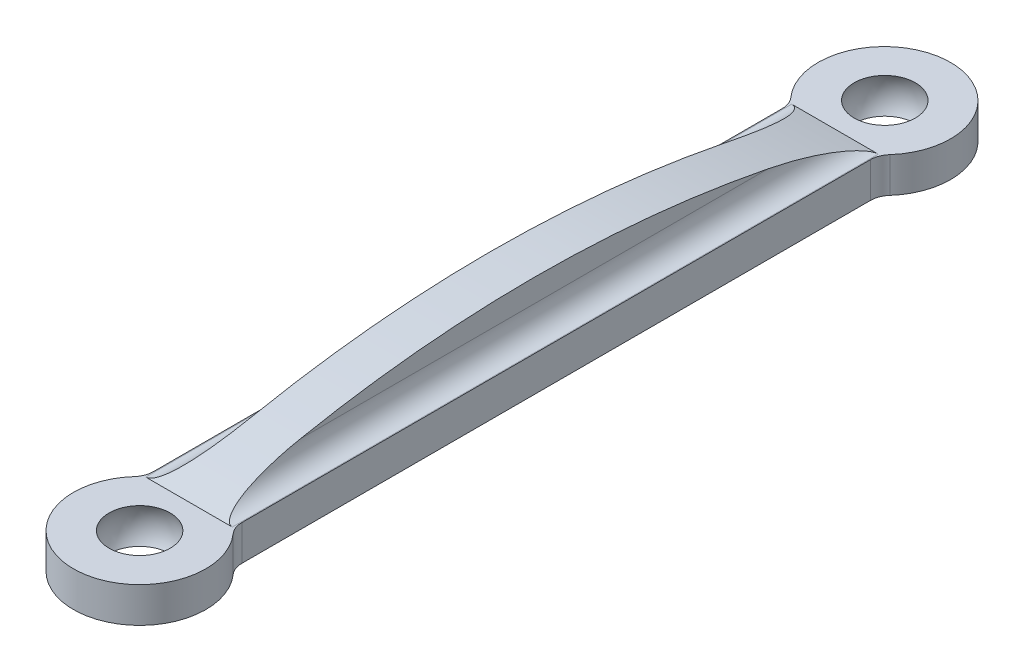
ISO-10303-21;
HEADER;
FILE_DESCRIPTION(('STEP AP214'),'2;1');
FILE_NAME('part.step','',(''),(''),'','','');
FILE_SCHEMA(('AUTOMOTIVE_DESIGN { 1 0 10303 214 1 1 1 1 }'));
ENDSEC;
DATA;
#1=APPLICATION_CONTEXT('core data for automotive mechanical design processes');
#2=APPLICATION_PROTOCOL_DEFINITION('international standard','automotive_design',2000,#1);
#3=PRODUCT_CONTEXT('',#1,'mechanical');
#4=PRODUCT('Part','Part','',(#3));
#5=PRODUCT_RELATED_PRODUCT_CATEGORY('part','',(#4));
#6=PRODUCT_DEFINITION_FORMATION('','',#4);
#7=PRODUCT_DEFINITION_CONTEXT('part definition',#1,'design');
#8=PRODUCT_DEFINITION('design','',#6,#7);
#9=PRODUCT_DEFINITION_SHAPE('','',#8);
#10=(LENGTH_UNIT() NAMED_UNIT(*) SI_UNIT(.MILLI.,.METRE.));
#11=(NAMED_UNIT(*) PLANE_ANGLE_UNIT() SI_UNIT($,.RADIAN.));
#12=(NAMED_UNIT(*) SI_UNIT($,.STERADIAN.) SOLID_ANGLE_UNIT());
#13=UNCERTAINTY_MEASURE_WITH_UNIT(LENGTH_MEASURE(1.E-05),#10,'distance_accuracy_value','');
#14=(GEOMETRIC_REPRESENTATION_CONTEXT(3) GLOBAL_UNCERTAINTY_ASSIGNED_CONTEXT((#13)) GLOBAL_UNIT_ASSIGNED_CONTEXT((#10,
#11,#12)) REPRESENTATION_CONTEXT('',''));
#15=CARTESIAN_POINT('',(0.,0.,0.));
#16=DIRECTION('',(0.,0.,1.));
#17=DIRECTION('',(1.,0.,0.));
#18=AXIS2_PLACEMENT_3D('',#15,#16,#17);
#19=CARTESIAN_POINT('',(0.,1.27,0.));
#20=DIRECTION('',(0.,1.,0.));
#21=DIRECTION('',(0.,0.,1.));
#22=AXIS2_PLACEMENT_3D('',#19,#20,#21);
#23=PLANE('',#22);
#24=CARTESIAN_POINT('',(0.,1.27,-53.574492193178));
#25=DIRECTION('',(0.,1.,0.));
#26=DIRECTION('',(0.,0.,1.));
#27=AXIS2_PLACEMENT_3D('',#24,#25,#26);
#28=CIRCLE('',#27,2.19970452561247);
#29=CARTESIAN_POINT('',(0.,1.27,-51.3747876675655));
#30=VERTEX_POINT('',#29);
#31=EDGE_CURVE('E159',#30,#30,#28,.T.);
#32=ORIENTED_EDGE('',*,*,#31,.F.);
#33=EDGE_LOOP('',(#32));
#34=FACE_BOUND('',#33,.T.);
#35=CARTESIAN_POINT('',(0.,1.27,0.));
#36=DIRECTION('',(0.,1.,0.));
#37=DIRECTION('',(0.,0.,1.));
#38=AXIS2_PLACEMENT_3D('',#35,#36,#37);
#39=CIRCLE('',#38,2.19970452561247);
#40=CARTESIAN_POINT('',(0.,1.27,2.19970452561247));
#41=VERTEX_POINT('',#40);
#42=EDGE_CURVE('E158',#41,#41,#39,.T.);
#43=ORIENTED_EDGE('',*,*,#42,.F.);
#44=EDGE_LOOP('',(#43));
#45=FACE_BOUND('',#44,.T.);
#46=DIRECTION('',(0.,0.,1.));
#47=VECTOR('',#46,1.);
#48=CARTESIAN_POINT('',(-3.17499999999999,1.27,-3.54975791428093));
#49=LINE('',#48,#47);
#50=CARTESIAN_POINT('',(-3.175,1.27,-49.3671395059458));
#51=VERTEX_POINT('',#50);
#52=CARTESIAN_POINT('',(-3.17499999999999,1.27,-4.1760604940542));
#53=VERTEX_POINT('',#52);
#54=EDGE_CURVE('E140',#51,#53,#49,.T.);
#55=ORIENTED_EDGE('',*,*,#54,.T.);
#56=CARTESIAN_POINT('',(-4.69899999999999,1.27,-4.1760604940542));
#57=DIRECTION('',(0.,1.,0.));
#58=DIRECTION('',(0.,0.,1.));
#59=AXIS2_PLACEMENT_3D('',#56,#57,#58);
#60=CIRCLE('',#59,1.524);
#61=CARTESIAN_POINT('',(-3.55984848484848,1.27,-3.1636821924653));
#62=VERTEX_POINT('',#61);
#63=EDGE_CURVE('E236',#53,#62,#60,.F.);
#64=ORIENTED_EDGE('',*,*,#63,.T.);
#65=CARTESIAN_POINT('',(0.,1.27,0.));
#66=DIRECTION('',(0.,1.,0.));
#67=DIRECTION('',(0.,0.,1.));
#68=AXIS2_PLACEMENT_3D('',#65,#66,#67);
#69=CIRCLE('',#68,4.76250000000001);
#70=CARTESIAN_POINT('',(3.55984848484849,1.27,-3.16368219246529));
#71=VERTEX_POINT('',#70);
#72=EDGE_CURVE('E145',#62,#71,#69,.T.);
#73=ORIENTED_EDGE('',*,*,#72,.T.);
#74=CARTESIAN_POINT('',(4.69900000000001,1.27,-4.17606049405419));
#75=DIRECTION('',(0.,1.,0.));
#76=DIRECTION('',(0.,0.,1.));
#77=AXIS2_PLACEMENT_3D('',#74,#75,#76);
#78=CIRCLE('',#77,1.524);
#79=CARTESIAN_POINT('',(3.17500000000001,1.27,-4.17606049405418));
#80=VERTEX_POINT('',#79);
#81=EDGE_CURVE('E11',#71,#80,#78,.F.);
#82=ORIENTED_EDGE('',*,*,#81,.T.);
#83=DIRECTION('',(0.,0.,-1.));
#84=VECTOR('',#83,1.);
#85=CARTESIAN_POINT('',(3.175,1.27,-49.9934420857191));
#86=LINE('',#85,#84);
#87=CARTESIAN_POINT('',(3.175,1.27,-49.3671395059458));
#88=VERTEX_POINT('',#87);
#89=EDGE_CURVE('E149',#80,#88,#86,.T.);
#90=ORIENTED_EDGE('',*,*,#89,.T.);
#91=CARTESIAN_POINT('',(4.699,1.27,-49.3671395059458));
#92=DIRECTION('',(0.,1.,0.));
#93=DIRECTION('',(0.,0.,1.));
#94=AXIS2_PLACEMENT_3D('',#91,#92,#93);
#95=CIRCLE('',#94,1.524);
#96=CARTESIAN_POINT('',(3.55984848484849,1.27,-50.3795178075347));
#97=VERTEX_POINT('',#96);
#98=EDGE_CURVE('E190',#88,#97,#95,.F.);
#99=ORIENTED_EDGE('',*,*,#98,.T.);
#100=CARTESIAN_POINT('',(0.,1.27,-53.5432));
#101=DIRECTION('',(0.,1.,0.));
#102=DIRECTION('',(0.,0.,1.));
#103=AXIS2_PLACEMENT_3D('',#100,#101,#102);
#104=CIRCLE('',#103,4.76250000000001);
#105=CARTESIAN_POINT('',(-3.55984848484849,1.27,-50.3795178075347));
#106=VERTEX_POINT('',#105);
#107=EDGE_CURVE('E315',#97,#106,#104,.T.);
#108=ORIENTED_EDGE('',*,*,#107,.T.);
#109=CARTESIAN_POINT('',(-4.699,1.27,-49.3671395059458));
#110=DIRECTION('',(0.,1.,0.));
#111=DIRECTION('',(0.,0.,1.));
#112=AXIS2_PLACEMENT_3D('',#109,#110,#111);
#113=CIRCLE('',#112,1.524);
#114=EDGE_CURVE('E131',#106,#51,#113,.F.);
#115=ORIENTED_EDGE('',*,*,#114,.T.);
#116=EDGE_LOOP('',(#55,#64,#73,#82,#90,#99,#108,#115));
#117=FACE_BOUND('',#116,.T.);
#118=DIRECTION('',(-1.,0.,0.));
#119=VECTOR('',#118,1.);
#120=CARTESIAN_POINT('',(1.5875,1.27,-49.9934420857191));
#121=LINE('',#120,#119);
#122=CARTESIAN_POINT('',(3.1115,1.27,-49.9934420857191));
#123=VERTEX_POINT('',#122);
#124=CARTESIAN_POINT('',(-3.1115,1.27,-49.9934420857191));
#125=VERTEX_POINT('',#124);
#126=EDGE_CURVE('E301',#123,#125,#121,.T.);
#127=ORIENTED_EDGE('',*,*,#126,.F.);
#128=DIRECTION('',(0.,0.,-1.));
#129=VECTOR('',#128,1.);
#130=CARTESIAN_POINT('',(3.1115,1.27,0.));
#131=LINE('',#130,#129);
#132=CARTESIAN_POINT('',(3.1115,1.27,-3.54975791428093));
#133=VERTEX_POINT('',#132);
#134=EDGE_CURVE('E179',#123,#133,#131,.F.);
#135=ORIENTED_EDGE('',*,*,#134,.T.);
#136=DIRECTION('',(-1.,0.,0.));
#137=VECTOR('',#136,1.);
#138=CARTESIAN_POINT('',(1.5875,1.27,-3.54975791428093));
#139=LINE('',#138,#137);
#140=CARTESIAN_POINT('',(-3.1115,1.27,-3.54975791428093));
#141=VERTEX_POINT('',#140);
#142=EDGE_CURVE('E163',#133,#141,#139,.T.);
#143=ORIENTED_EDGE('',*,*,#142,.T.);
#144=DIRECTION('',(0.,0.,-1.));
#145=VECTOR('',#144,1.);
#146=CARTESIAN_POINT('',(-3.1115,1.27,-49.9934420857191));
#147=LINE('',#146,#145);
#148=EDGE_CURVE('E176',#141,#125,#147,.T.);
#149=ORIENTED_EDGE('',*,*,#148,.T.);
#150=EDGE_LOOP('',(#127,#135,#143,#149));
#151=FACE_BOUND('',#150,.T.);
#152=ADVANCED_FACE('F33',(#34,#45,#117,#151),#23,.T.);
#153=CARTESIAN_POINT('',(0.,-1.27,0.));
#154=DIRECTION('',(0.,1.,0.));
#155=DIRECTION('',(0.,0.,1.));
#156=AXIS2_PLACEMENT_3D('',#153,#154,#155);
#157=PLANE('',#156);
#158=CARTESIAN_POINT('',(0.,-1.27,-53.574492193178));
#159=DIRECTION('',(0.,1.,0.));
#160=DIRECTION('',(0.,0.,1.));
#161=AXIS2_PLACEMENT_3D('',#158,#159,#160);
#162=CIRCLE('',#161,2.19970452561247);
#163=CARTESIAN_POINT('',(0.,-1.27,-51.3747876675655));
#164=VERTEX_POINT('',#163);
#165=EDGE_CURVE('E160',#164,#164,#162,.T.);
#166=ORIENTED_EDGE('',*,*,#165,.T.);
#167=EDGE_LOOP('',(#166));
#168=FACE_BOUND('',#167,.T.);
#169=CARTESIAN_POINT('',(0.,-1.27,0.));
#170=DIRECTION('',(0.,1.,0.));
#171=DIRECTION('',(0.,0.,1.));
#172=AXIS2_PLACEMENT_3D('',#169,#170,#171);
#173=CIRCLE('',#172,2.19970452561247);
#174=CARTESIAN_POINT('',(0.,-1.27,2.19970452561247));
#175=VERTEX_POINT('',#174);
#176=EDGE_CURVE('E155',#175,#175,#173,.T.);
#177=ORIENTED_EDGE('',*,*,#176,.T.);
#178=EDGE_LOOP('',(#177));
#179=FACE_BOUND('',#178,.T.);
#180=CARTESIAN_POINT('',(0.,-1.27,0.));
#181=DIRECTION('',(0.,1.,0.));
#182=DIRECTION('',(0.,0.,1.));
#183=AXIS2_PLACEMENT_3D('',#180,#181,#182);
#184=CIRCLE('',#183,4.76250000000001);
#185=CARTESIAN_POINT('',(-3.55984848484848,-1.27,-3.1636821924653));
#186=VERTEX_POINT('',#185);
#187=CARTESIAN_POINT('',(3.55984848484849,-1.27,-3.16368219246529));
#188=VERTEX_POINT('',#187);
#189=EDGE_CURVE('E311',#186,#188,#184,.T.);
#190=ORIENTED_EDGE('',*,*,#189,.F.);
#191=CARTESIAN_POINT('',(-4.69899999999999,-1.27,-4.1760604940542));
#192=DIRECTION('',(0.,1.,0.));
#193=DIRECTION('',(0.,0.,1.));
#194=AXIS2_PLACEMENT_3D('',#191,#192,#193);
#195=CIRCLE('',#194,1.524);
#196=CARTESIAN_POINT('',(-3.17499999999999,-1.27,-4.1760604940542));
#197=VERTEX_POINT('',#196);
#198=EDGE_CURVE('E55',#186,#197,#195,.T.);
#199=ORIENTED_EDGE('',*,*,#198,.T.);
#200=DIRECTION('',(0.,0.,1.));
#201=VECTOR('',#200,1.);
#202=CARTESIAN_POINT('',(-3.17499999999999,-1.27,-3.54975791428093));
#203=LINE('',#202,#201);
#204=CARTESIAN_POINT('',(-3.175,-1.27,-49.3671395059458));
#205=VERTEX_POINT('',#204);
#206=EDGE_CURVE('E138',#205,#197,#203,.T.);
#207=ORIENTED_EDGE('',*,*,#206,.F.);
#208=CARTESIAN_POINT('',(-4.699,-1.27,-49.3671395059458));
#209=DIRECTION('',(0.,1.,0.));
#210=DIRECTION('',(0.,0.,1.));
#211=AXIS2_PLACEMENT_3D('',#208,#209,#210);
#212=CIRCLE('',#211,1.524);
#213=CARTESIAN_POINT('',(-3.55984848484849,-1.27,-50.3795178075347));
#214=VERTEX_POINT('',#213);
#215=EDGE_CURVE('E122',#205,#214,#212,.T.);
#216=ORIENTED_EDGE('',*,*,#215,.T.);
#217=CARTESIAN_POINT('',(0.,-1.27,-53.5432));
#218=DIRECTION('',(0.,1.,0.));
#219=DIRECTION('',(0.,0.,1.));
#220=AXIS2_PLACEMENT_3D('',#217,#218,#219);
#221=CIRCLE('',#220,4.76250000000001);
#222=CARTESIAN_POINT('',(3.55984848484849,-1.27,-50.3795178075347));
#223=VERTEX_POINT('',#222);
#224=EDGE_CURVE('E146',#223,#214,#221,.T.);
#225=ORIENTED_EDGE('',*,*,#224,.F.);
#226=CARTESIAN_POINT('',(4.699,-1.27,-49.3671395059458));
#227=DIRECTION('',(0.,1.,0.));
#228=DIRECTION('',(0.,0.,1.));
#229=AXIS2_PLACEMENT_3D('',#226,#227,#228);
#230=CIRCLE('',#229,1.524);
#231=CARTESIAN_POINT('',(3.175,-1.27,-49.3671395059458));
#232=VERTEX_POINT('',#231);
#233=EDGE_CURVE('E188',#223,#232,#230,.T.);
#234=ORIENTED_EDGE('',*,*,#233,.T.);
#235=DIRECTION('',(0.,0.,-1.));
#236=VECTOR('',#235,1.);
#237=CARTESIAN_POINT('',(3.175,-1.27,-49.9934420857191));
#238=LINE('',#237,#236);
#239=CARTESIAN_POINT('',(3.17500000000001,-1.27,-4.17606049405418));
#240=VERTEX_POINT('',#239);
#241=EDGE_CURVE('E151',#240,#232,#238,.T.);
#242=ORIENTED_EDGE('',*,*,#241,.F.);
#243=CARTESIAN_POINT('',(4.69900000000001,-1.27,-4.17606049405419));
#244=DIRECTION('',(0.,1.,0.));
#245=DIRECTION('',(0.,0.,1.));
#246=AXIS2_PLACEMENT_3D('',#243,#244,#245);
#247=CIRCLE('',#246,1.524);
#248=EDGE_CURVE('E41',#240,#188,#247,.T.);
#249=ORIENTED_EDGE('',*,*,#248,.T.);
#250=EDGE_LOOP('',(#190,#199,#207,#216,#225,#234,#242,#249));
#251=FACE_BOUND('',#250,.T.);
#252=ADVANCED_FACE('F144',(#168,#179,#251),#157,.F.);
#253=CARTESIAN_POINT('',(0.,1.27,0.));
#254=DIRECTION('',(0.,-1.,0.));
#255=DIRECTION('',(0.,0.,-1.));
#256=AXIS2_PLACEMENT_3D('',#253,#254,#255);
#257=CYLINDRICAL_SURFACE('',#256,4.76250000000001);
#258=ORIENTED_EDGE('',*,*,#72,.F.);
#259=DIRECTION('',(0.,-1.,0.));
#260=VECTOR('',#259,1.);
#261=CARTESIAN_POINT('',(-3.55984848484848,1.27,-3.1636821924653));
#262=LINE('',#261,#260);
#263=EDGE_CURVE('E132',#62,#186,#262,.T.);
#264=ORIENTED_EDGE('',*,*,#263,.T.);
#265=ORIENTED_EDGE('',*,*,#189,.T.);
#266=DIRECTION('',(0.,-1.,0.));
#267=VECTOR('',#266,1.);
#268=CARTESIAN_POINT('',(3.55984848484849,1.27,-3.16368219246529));
#269=LINE('',#268,#267);
#270=EDGE_CURVE('E184',#188,#71,#269,.F.);
#271=ORIENTED_EDGE('',*,*,#270,.T.);
#272=EDGE_LOOP('',(#258,#264,#265,#271));
#273=FACE_BOUND('',#272,.T.);
#274=ADVANCED_FACE('F243',(#273),#257,.T.);
#275=CARTESIAN_POINT('',(3.175,1.27,-49.9934420857191));
#276=DIRECTION('',(-1.,0.,0.));
#277=DIRECTION('',(0.,0.,1.));
#278=AXIS2_PLACEMENT_3D('',#275,#276,#277);
#279=PLANE('',#278);
#280=ORIENTED_EDGE('',*,*,#241,.T.);
#281=DIRECTION('',(0.,1.,0.));
#282=VECTOR('',#281,1.);
#283=CARTESIAN_POINT('',(3.175,1.27,-49.3671395059458));
#284=LINE('',#283,#282);
#285=EDGE_CURVE('E171',#232,#88,#284,.T.);
#286=ORIENTED_EDGE('',*,*,#285,.T.);
#287=ORIENTED_EDGE('',*,*,#89,.F.);
#288=DIRECTION('',(0.,1.,0.));
#289=VECTOR('',#288,1.);
#290=CARTESIAN_POINT('',(3.17500000000001,-1.27,-4.17606049405419));
#291=LINE('',#290,#289);
#292=EDGE_CURVE('E168',#80,#240,#291,.F.);
#293=ORIENTED_EDGE('',*,*,#292,.T.);
#294=EDGE_LOOP('',(#280,#286,#287,#293));
#295=FACE_BOUND('',#294,.T.);
#296=ADVANCED_FACE('F268',(#295),#279,.F.);
#297=CARTESIAN_POINT('',(0.,1.27,-53.5432));
#298=DIRECTION('',(0.,-1.,0.));
#299=DIRECTION('',(0.,0.,-1.));
#300=AXIS2_PLACEMENT_3D('',#297,#298,#299);
#301=CYLINDRICAL_SURFACE('',#300,4.76250000000001);
#302=ORIENTED_EDGE('',*,*,#224,.T.);
#303=DIRECTION('',(0.,-1.,0.));
#304=VECTOR('',#303,1.);
#305=CARTESIAN_POINT('',(-3.55984848484849,1.27,-50.3795178075347));
#306=LINE('',#305,#304);
#307=EDGE_CURVE('E127',#214,#106,#306,.F.);
#308=ORIENTED_EDGE('',*,*,#307,.T.);
#309=ORIENTED_EDGE('',*,*,#107,.F.);
#310=DIRECTION('',(0.,-1.,0.));
#311=VECTOR('',#310,1.);
#312=CARTESIAN_POINT('',(3.55984848484849,1.27,-50.3795178075347));
#313=LINE('',#312,#311);
#314=EDGE_CURVE('E141',#97,#223,#313,.T.);
#315=ORIENTED_EDGE('',*,*,#314,.T.);
#316=EDGE_LOOP('',(#302,#308,#309,#315));
#317=FACE_BOUND('',#316,.T.);
#318=ADVANCED_FACE('F265',(#317),#301,.T.);
#319=CARTESIAN_POINT('',(-3.17499999999999,1.27,-3.54975791428093));
#320=DIRECTION('',(1.,0.,0.));
#321=DIRECTION('',(0.,0.,-1.));
#322=AXIS2_PLACEMENT_3D('',#319,#320,#321);
#323=PLANE('',#322);
#324=ORIENTED_EDGE('',*,*,#54,.F.);
#325=DIRECTION('',(0.,1.,0.));
#326=VECTOR('',#325,1.);
#327=CARTESIAN_POINT('',(-3.175,-1.27,-49.3671395059458));
#328=LINE('',#327,#326);
#329=EDGE_CURVE('E126',#51,#205,#328,.F.);
#330=ORIENTED_EDGE('',*,*,#329,.T.);
#331=ORIENTED_EDGE('',*,*,#206,.T.);
#332=DIRECTION('',(0.,1.,0.));
#333=VECTOR('',#332,1.);
#334=CARTESIAN_POINT('',(-3.17499999999999,1.27,-4.1760604940542));
#335=LINE('',#334,#333);
#336=EDGE_CURVE('E142',#197,#53,#335,.T.);
#337=ORIENTED_EDGE('',*,*,#336,.T.);
#338=EDGE_LOOP('',(#324,#330,#331,#337));
#339=FACE_BOUND('',#338,.T.);
#340=ADVANCED_FACE('F137',(#339),#323,.F.);
#341=CARTESIAN_POINT('',(0.,0.,0.));
#342=DIRECTION('',(0.,-1.,0.));
#343=DIRECTION('',(0.,0.,1.));
#344=AXIS2_PLACEMENT_3D('',#341,#342,#343);
#345=SPHERICAL_SURFACE('',#344,2.54);
#346=ORIENTED_EDGE('',*,*,#42,.T.);
#347=EDGE_LOOP('',(#346));
#348=FACE_BOUND('',#347,.T.);
#349=ORIENTED_EDGE('',*,*,#176,.F.);
#350=EDGE_LOOP('',(#349));
#351=FACE_BOUND('',#350,.T.);
#352=ADVANCED_FACE('F261',(#348,#351),#345,.F.);
#353=CARTESIAN_POINT('',(0.,0.,-53.574492193178));
#354=DIRECTION('',(0.,1.,0.));
#355=DIRECTION('',(0.,0.,-1.));
#356=AXIS2_PLACEMENT_3D('',#353,#354,#355);
#357=SPHERICAL_SURFACE('',#356,2.54);
#358=ORIENTED_EDGE('',*,*,#31,.T.);
#359=EDGE_LOOP('',(#358));
#360=FACE_BOUND('',#359,.T.);
#361=ORIENTED_EDGE('',*,*,#165,.F.);
#362=EDGE_LOOP('',(#361));
#363=FACE_BOUND('',#362,.T.);
#364=ADVANCED_FACE('F330',(#360,#363),#357,.F.);
#365=CARTESIAN_POINT('',(1.5875,-82.0643818667832,-26.7716));
#366=DIRECTION('',(-1.,0.,0.));
#367=DIRECTION('',(0.,0.,1.));
#368=AXIS2_PLACEMENT_3D('',#365,#366,#367);
#369=CYLINDRICAL_SURFACE('',#368,86.5093818667832);
#370=ORIENTED_EDGE('',*,*,#126,.T.);
#371=CARTESIAN_POINT('',(-3.1115,1.27,-49.9934420857191));
#372=CARTESIAN_POINT('',(-3.08364758109614,1.26997319373215,-49.9935367678956));
#373=CARTESIAN_POINT('',(-3.05594343790235,1.27076224177629,-49.9907068020131));
#374=CARTESIAN_POINT('',(-3.00199605829185,1.27371021320992,-49.9801244304795));
#375=CARTESIAN_POINT('',(-2.97573675418271,1.27584752856914,-49.9724496687061));
#376=CARTESIAN_POINT('',(-2.91889510007726,1.28188516418915,-49.9507515665316));
#377=CARTESIAN_POINT('',(-2.88876670045398,1.28608359289051,-49.9356535141415));
#378=CARTESIAN_POINT('',(-2.83124629074053,1.29570482293575,-49.9010061320039));
#379=CARTESIAN_POINT('',(-2.80387328345638,1.30113538412754,-49.881428583925));
#380=CARTESIAN_POINT('',(-2.73192428091734,1.31727112033838,-49.8231630653771));
#381=CARTESIAN_POINT('',(-2.69016042568539,1.32883903886,-49.7812922936193));
#382=CARTESIAN_POINT('',(-2.61298543052403,1.35327515622433,-49.6925468125347));
#383=CARTESIAN_POINT('',(-2.5775868490207,1.3661458489044,-49.6456624959591));
#384=CARTESIAN_POINT('',(-2.4942539622278,1.39953335733112,-49.523606621993));
#385=CARTESIAN_POINT('',(-2.449440174364,1.42052997391905,-49.4464601120537));
#386=CARTESIAN_POINT('',(-2.36725105079821,1.46328816834014,-49.2884437651358));
#387=CARTESIAN_POINT('',(-2.32989317388563,1.4850514044112,-49.2075657227145));
#388=CARTESIAN_POINT('',(-2.26053744175345,1.52903693697994,-49.0431236311925));
#389=CARTESIAN_POINT('',(-2.22857066745932,1.55126111773577,-48.9595471097046));
#390=CARTESIAN_POINT('',(-2.16901731493431,1.59580156706737,-48.7910108743999));
#391=CARTESIAN_POINT('',(-2.14142581261858,1.61811770270072,-48.7060528358871));
#392=CARTESIAN_POINT('',(-2.09086782102221,1.66176737188193,-48.538828173018));
#393=CARTESIAN_POINT('',(-2.06775179455811,1.68310117772008,-48.4566064244204));
#394=CARTESIAN_POINT('',(-2.02419713978219,1.72569590453733,-48.2914349683799));
#395=CARTESIAN_POINT('',(-2.0037587896142,1.74695681772168,-48.2084851862659));
#396=CARTESIAN_POINT('',(-1.94584156195826,1.81057592351199,-47.9587215039469));
#397=CARTESIAN_POINT('',(-1.91178181842386,1.85275132509501,-47.7910666229097));
#398=CARTESIAN_POINT('',(-1.85059257897426,1.93646419790429,-47.4539900086592));
#399=CARTESIAN_POINT('',(-1.8234778744861,1.97800013337119,-47.2845652912642));
#400=CARTESIAN_POINT('',(-1.77492432395665,2.06022879103218,-46.9446910950073));
#401=CARTESIAN_POINT('',(-1.75348605903834,2.10092142650105,-46.7742415130507));
#402=CARTESIAN_POINT('',(-1.71534668932898,2.1813731124686,-46.4326453480658));
#403=CARTESIAN_POINT('',(-1.69864444734894,2.22113238497488,-46.2614989423837));
#404=CARTESIAN_POINT('',(-1.66928672304124,2.29968160592195,-45.9186333537102));
#405=CARTESIAN_POINT('',(-1.65663149006867,2.33847149449878,-45.7469141360835));
#406=CARTESIAN_POINT('',(-1.62394756413586,2.45324657645821,-45.2314868783443));
#407=CARTESIAN_POINT('',(-1.60915821265009,2.52773266115203,-44.8871039397341));
#408=CARTESIAN_POINT('',(-1.59562250363965,2.63336831510689,-44.3838248825355));
#409=CARTESIAN_POINT('',(-1.59252545137741,2.66616477809916,-44.2253621769135));
#410=CARTESIAN_POINT('',(-1.58846789896315,2.73078668498993,-43.9086529505558));
#411=CARTESIAN_POINT('',(-1.5875017028196,2.76261449276451,-43.7504069862823));
#412=CARTESIAN_POINT('',(-1.5875,2.794,-43.5920690161754));
#413=B_SPLINE_CURVE_WITH_KNOTS('',3,(#371,#372,#373,#374,#375,#376,#377,#378,#379,#380,#381,
#382,#383,#384,#385,#386,#387,#388,#389,#390,#391,#392,#393,#394,#395,#396,#397,#398,#399,#400,
#401,#402,#403,#404,#405,#406,#407,#408,#409,#410,#411,#412),.UNSPECIFIED.,.F.,.F.,(4,2,2,2,2,2,
2,2,2,2,2,2,2,2,2,2,2,2,2,2,4),(0.,0.0831655632655568,0.165031003275695,0.266334310204229,
0.368294253649901,0.548059192920485,0.728175000047763,1.00244842773504,1.27735674838377,
1.55379947692134,1.82992884451972,2.09397696234355,2.35805248647522,2.88643945489353,
3.41594258715358,3.94549990612061,4.47492996267931,5.00439263360949,6.06206338914696,
6.54760526399406,7.03184765563528),.UNSPECIFIED.);
#414=CARTESIAN_POINT('',(-1.5875,2.794,-43.5920690161754));
#415=VERTEX_POINT('',#414);
#416=EDGE_CURVE('E224',#125,#415,#413,.T.);
#417=ORIENTED_EDGE('',*,*,#416,.T.);
#418=CARTESIAN_POINT('',(-1.5875,-82.0643818667832,-26.7716));
#419=DIRECTION('',(1.,0.,0.));
#420=DIRECTION('',(0.,0.,1.));
#421=AXIS2_PLACEMENT_3D('',#418,#419,#420);
#422=CIRCLE('',#421,86.5093818667832);
#423=CARTESIAN_POINT('',(-1.5875,2.794,-9.95113098382461));
#424=VERTEX_POINT('',#423);
#425=EDGE_CURVE('E290',#415,#424,#422,.T.);
#426=ORIENTED_EDGE('',*,*,#425,.T.);
#427=CARTESIAN_POINT('',(-1.5875,2.794,-9.95113098382461));
#428=CARTESIAN_POINT('',(-1.5875389530853,2.7451255826658,-9.70455720294964));
#429=CARTESIAN_POINT('',(-1.58985517105274,2.6951707871185,-9.45817753248845));
#430=CARTESIAN_POINT('',(-1.599917547404,2.59310214749364,-8.96579282853195));
#431=CARTESIAN_POINT('',(-1.60766766075974,2.54098675687265,-8.71978819878257));
#432=CARTESIAN_POINT('',(-1.62973198666327,2.4334206693995,-8.22272679572881));
#433=CARTESIAN_POINT('',(-1.64419618421782,2.37792037233581,-7.97168716221814));
#434=CARTESIAN_POINT('',(-1.68107841459768,2.26483283998371,-7.47075599876178));
#435=CARTESIAN_POINT('',(-1.70349302402621,2.20724651249433,-7.22086402148171));
#436=CARTESIAN_POINT('',(-1.75389472856408,2.09942565006821,-6.76227792984917));
#437=CARTESIAN_POINT('',(-1.78042694092055,2.04947991448805,-6.55335748998311));
#438=CARTESIAN_POINT('',(-1.84229538144545,1.94828109508338,-6.13688323350398));
#439=CARTESIAN_POINT('',(-1.8776396346456,1.89702685802174,-5.92933084058099));
#440=CARTESIAN_POINT('',(-1.93919972854061,1.81965466061947,-5.62088650017503));
#441=CARTESIAN_POINT('',(-1.9610217203488,1.79390400062775,-5.51902344487382));
#442=CARTESIAN_POINT('',(-2.00806504165965,1.74222389878854,-5.31613612250339));
#443=CARTESIAN_POINT('',(-2.0332859101984,1.71629448163621,-5.2151117436598));
#444=CARTESIAN_POINT('',(-2.08780357557715,1.66438220875799,-5.01434941100573));
#445=CARTESIAN_POINT('',(-2.11709415726374,1.63839949294107,-4.91460974433121));
#446=CARTESIAN_POINT('',(-2.18080349361537,1.58649133989011,-4.71678196698488));
#447=CARTESIAN_POINT('',(-2.21521962149903,1.56056588017948,-4.61869303882169));
#448=CARTESIAN_POINT('',(-2.26598882375885,1.52595821870044,-4.48866073590886));
#449=CARTESIAN_POINT('',(-2.27935990369814,1.51713401392756,-4.4555852444853));
#450=CARTESIAN_POINT('',(-2.30700116341848,1.49954006228389,-4.38979351923975));
#451=CARTESIAN_POINT('',(-2.32127140441859,1.49077031916586,-4.35707731005784));
#452=CARTESIAN_POINT('',(-2.36566988575775,1.4645260023871,-4.25939764898099));
#453=CARTESIAN_POINT('',(-2.39731561049898,1.44716525882785,-4.1950869031861));
#454=CARTESIAN_POINT('',(-2.46962304553144,1.41110515379764,-4.06209896850867));
#455=CARTESIAN_POINT('',(-2.51089391703325,1.39246899242675,-3.99372114132266));
#456=CARTESIAN_POINT('',(-2.57956742073488,1.36563894064276,-3.89571891078493));
#457=CARTESIAN_POINT('',(-2.60354544253302,1.35689523252615,-3.86385664269052));
#458=CARTESIAN_POINT('',(-2.65426514290177,1.3399608082267,-3.80227729123602));
#459=CARTESIAN_POINT('',(-2.68100323418912,1.33176939656471,-3.7725575065609));
#460=CARTESIAN_POINT('',(-2.73245078563098,1.31769845265911,-3.72160228910297));
#461=CARTESIAN_POINT('',(-2.75658088341827,1.31167532969347,-3.69982756077727));
#462=CARTESIAN_POINT('',(-2.80740661000876,1.30042035084622,-3.65919326776327));
#463=CARTESIAN_POINT('',(-2.83410184261843,1.29518837308987,-3.64033325405767));
#464=CARTESIAN_POINT('',(-2.88610449417541,1.28656475589043,-3.60927996146244));
#465=CARTESIAN_POINT('',(-2.9110380027946,1.28301559504785,-3.59651403486657));
#466=CARTESIAN_POINT('',(-2.96271021222162,1.2770598287209,-3.57510518197203));
#467=CARTESIAN_POINT('',(-2.98944213265463,1.27464917937321,-3.56644766254497));
#468=CARTESIAN_POINT('',(-3.03226329107183,1.27198196550213,-3.55687132598993));
#469=CARTESIAN_POINT('',(-3.04794513704828,1.2712446328782,-3.55422476923457));
#470=CARTESIAN_POINT('',(-3.07957872948234,1.27025108677695,-3.55065896369396));
#471=CARTESIAN_POINT('',(-3.09553128274002,1.26999673695319,-3.54974640576551));
#472=CARTESIAN_POINT('',(-3.11150000000001,1.27,-3.54975791428099));
#473=B_SPLINE_CURVE_WITH_KNOTS('',3,(#427,#428,#429,#430,#431,#432,#433,#434,#435,#436,#437,
#438,#439,#440,#441,#442,#443,#444,#445,#446,#447,#448,#449,#450,#451,#452,#453,#454,#455,#456,
#457,#458,#459,#460,#461,#462,#463,#464,#465,#466,#467,#468,#469,#470,#471,#472),.UNSPECIFIED.,
.F.,.F.,(4,2,2,2,2,2,2,2,2,2,2,2,2,2,2,2,2,2,2,2,2,2,4),(0.,0.754129983146479,1.50880941802074,
2.28122487568906,3.05330813913358,3.70249683870906,4.35227892094081,4.67416502494469,
4.99600751782393,5.31736379634317,5.63855594674492,5.74879898499837,5.8590495372387,
6.08015778060824,6.32562203715895,6.44798761548992,6.57019611035441,6.6691916471519,
6.76817191826479,6.85258583532243,6.93669762592191,6.98436392592847,7.03221378189677),.UNSPECIFIED.);
#474=EDGE_CURVE('E229',#424,#141,#473,.T.);
#475=ORIENTED_EDGE('',*,*,#474,.T.);
#476=ORIENTED_EDGE('',*,*,#142,.F.);
#477=CARTESIAN_POINT('',(3.1115,1.27,-3.54975791428093));
#478=CARTESIAN_POINT('',(3.08364758109612,1.26997319373215,-3.54966323210435));
#479=CARTESIAN_POINT('',(3.05594343790234,1.27076224177629,-3.55249319798694));
#480=CARTESIAN_POINT('',(3.00199605829186,1.27371021320993,-3.56307556952052));
#481=CARTESIAN_POINT('',(2.97573675418272,1.27584752856914,-3.57075033129401));
#482=CARTESIAN_POINT('',(2.91889510007726,1.28188516418916,-3.59244843346849));
#483=CARTESIAN_POINT('',(2.88876670045396,1.28608359289051,-3.60754648585851));
#484=CARTESIAN_POINT('',(2.83124629074051,1.29570482293575,-3.64219386799611));
#485=CARTESIAN_POINT('',(2.80387328345638,1.30113538412754,-3.661771416075));
#486=CARTESIAN_POINT('',(2.73192428091734,1.31727112033839,-3.72003693462291));
#487=CARTESIAN_POINT('',(2.69016042568537,1.32883903886001,-3.76190770638071));
#488=CARTESIAN_POINT('',(2.612985430524,1.35327515622434,-3.85065318746524));
#489=CARTESIAN_POINT('',(2.5775868490207,1.36614584890441,-3.89753750404094));
#490=CARTESIAN_POINT('',(2.49425396222781,1.39953335733112,-4.01959337800705));
#491=CARTESIAN_POINT('',(2.44944017436399,1.42052997391906,-4.09673988794629));
#492=CARTESIAN_POINT('',(2.36725105079817,1.46328816834016,-4.25475623486422));
#493=CARTESIAN_POINT('',(2.3298931738856,1.48505140441123,-4.33563427728555));
#494=CARTESIAN_POINT('',(2.26053744175343,1.52903693697996,-4.50007636880755));
#495=CARTESIAN_POINT('',(2.2285706674593,1.55126111773579,-4.58365289029538));
#496=CARTESIAN_POINT('',(2.1690173149343,1.59580156706738,-4.75218912560012));
#497=CARTESIAN_POINT('',(2.14142581261859,1.61811770270071,-4.83714716411298));
#498=CARTESIAN_POINT('',(2.09086782102223,1.66176737188193,-5.00437182698206));
#499=CARTESIAN_POINT('',(2.06775179455811,1.68310117772008,-5.08659357557962));
#500=CARTESIAN_POINT('',(2.02419713978218,1.72569590453734,-5.25176503162009));
#501=CARTESIAN_POINT('',(2.0037587896142,1.74695681772169,-5.33471481373416));
#502=CARTESIAN_POINT('',(1.94584156195827,1.81057592351199,-5.58447849605313));
#503=CARTESIAN_POINT('',(1.91178181842385,1.85275132509502,-5.75213337709037));
#504=CARTESIAN_POINT('',(1.85059257897426,1.9364641979043,-6.08920999134087));
#505=CARTESIAN_POINT('',(1.8234778744861,1.9780001333712,-6.25863470873581));
#506=CARTESIAN_POINT('',(1.77492432395666,2.06022879103218,-6.59850890499271));
#507=CARTESIAN_POINT('',(1.75348605903834,2.10092142650104,-6.76895848694934));
#508=CARTESIAN_POINT('',(1.71534668932898,2.1813731124686,-7.11055465193423));
#509=CARTESIAN_POINT('',(1.69864444734894,2.22113238497489,-7.28170105761629));
#510=CARTESIAN_POINT('',(1.66928672304124,2.29968160592195,-7.62456664628981));
#511=CARTESIAN_POINT('',(1.65663149006867,2.33847149449877,-7.79628586391648));
#512=CARTESIAN_POINT('',(1.62394756413586,2.4532465764582,-8.3117131216557));
#513=CARTESIAN_POINT('',(1.60915821265009,2.52773266115204,-8.65609606026583));
#514=CARTESIAN_POINT('',(1.59562250363965,2.63336831510689,-9.15937511746445));
#515=CARTESIAN_POINT('',(1.59252545137741,2.66616477809916,-9.31783782308647));
#516=CARTESIAN_POINT('',(1.58846789896316,2.73078668498992,-9.63454704944423));
#517=CARTESIAN_POINT('',(1.5875017028196,2.7626144927645,-9.79279301371772));
#518=CARTESIAN_POINT('',(1.5875,2.794,-9.95113098382461));
#519=B_SPLINE_CURVE_WITH_KNOTS('',3,(#477,#478,#479,#480,#481,#482,#483,#484,#485,#486,#487,
#488,#489,#490,#491,#492,#493,#494,#495,#496,#497,#498,#499,#500,#501,#502,#503,#504,#505,#506,
#507,#508,#509,#510,#511,#512,#513,#514,#515,#516,#517,#518),.UNSPECIFIED.,.F.,.F.,(4,2,2,2,2,2,
2,2,2,2,2,2,2,2,2,2,2,2,2,2,4),(0.,0.0831655632655591,0.165031003275711,0.266334310204235,
0.368294253649897,0.548059192920478,0.728175000047758,1.00244842773506,1.27735674838379,
1.55379947692136,1.82992884451975,2.09397696234357,2.35805248647524,2.88643945489355,
3.41594258715358,3.9454999061206,4.4749299626793,5.00439263360946,6.06206338914692,
6.54760526399404,7.03184765563527),.UNSPECIFIED.);
#520=CARTESIAN_POINT('',(1.5875,2.794,-9.95113098382461));
#521=VERTEX_POINT('',#520);
#522=EDGE_CURVE('E200',#133,#521,#519,.T.);
#523=ORIENTED_EDGE('',*,*,#522,.T.);
#524=CARTESIAN_POINT('',(1.5875,-82.0643818667832,-26.7716));
#525=DIRECTION('',(1.,0.,0.));
#526=DIRECTION('',(0.,0.,1.));
#527=AXIS2_PLACEMENT_3D('',#524,#525,#526);
#528=CIRCLE('',#527,86.5093818667832);
#529=CARTESIAN_POINT('',(1.5875,2.794,-43.5920690161754));
#530=VERTEX_POINT('',#529);
#531=EDGE_CURVE('E294',#530,#521,#528,.T.);
#532=ORIENTED_EDGE('',*,*,#531,.F.);
#533=CARTESIAN_POINT('',(1.5875,2.794,-43.5920690161754));
#534=CARTESIAN_POINT('',(1.58753895308531,2.74512558266579,-43.8386427970504));
#535=CARTESIAN_POINT('',(1.58985517105274,2.69517078711849,-44.0850224675115));
#536=CARTESIAN_POINT('',(1.599917547404,2.59310214749365,-44.577407171468));
#537=CARTESIAN_POINT('',(1.60766766075974,2.54098675687266,-44.8234118012174));
#538=CARTESIAN_POINT('',(1.62973198666326,2.43342066939951,-45.3204732042712));
#539=CARTESIAN_POINT('',(1.64419618421782,2.37792037233581,-45.5715128377818));
#540=CARTESIAN_POINT('',(1.68107841459769,2.2648328399837,-46.0724440012382));
#541=CARTESIAN_POINT('',(1.70349302402622,2.20724651249433,-46.3223359785183));
#542=CARTESIAN_POINT('',(1.75389472856408,2.09942565006822,-46.7809220701508));
#543=CARTESIAN_POINT('',(1.78042694092054,2.04947991448807,-46.9898425100169));
#544=CARTESIAN_POINT('',(1.84229538144545,1.94828109508338,-47.406316766496));
#545=CARTESIAN_POINT('',(1.87763963464563,1.89702685802171,-47.6138691594189));
#546=CARTESIAN_POINT('',(1.9391997285406,1.81965466061948,-47.9223134998249));
#547=CARTESIAN_POINT('',(1.96102172034877,1.79390400062778,-48.0241765551261));
#548=CARTESIAN_POINT('',(2.00806504165963,1.74222389878857,-48.2270638774965));
#549=CARTESIAN_POINT('',(2.0332859101984,1.71629448163622,-48.3280882563401));
#550=CARTESIAN_POINT('',(2.08780357557714,1.664382208758,-48.5288505889942));
#551=CARTESIAN_POINT('',(2.11709415726371,1.6383994929411,-48.6285902556687));
#552=CARTESIAN_POINT('',(2.18080349361535,1.58649133989014,-48.826418033015));
#553=CARTESIAN_POINT('',(2.21521962149904,1.56056588017948,-48.9245069611782));
#554=CARTESIAN_POINT('',(2.26598882375881,1.52595821870047,-49.054539264091));
#555=CARTESIAN_POINT('',(2.27935990369808,1.5171340139276,-49.0876147555146));
#556=CARTESIAN_POINT('',(2.3070011634184,1.49954006228394,-49.1534064807601));
#557=CARTESIAN_POINT('',(2.32127140441852,1.49077031916591,-49.186122689942));
#558=CARTESIAN_POINT('',(2.3656698857577,1.46452600238713,-49.2838023510189));
#559=CARTESIAN_POINT('',(2.39731561049894,1.44716525882788,-49.3481130968138));
#560=CARTESIAN_POINT('',(2.4696230455314,1.41110515379767,-49.4811010314912));
#561=CARTESIAN_POINT('',(2.51089391703318,1.39246899242678,-49.5494788586772));
#562=CARTESIAN_POINT('',(2.57956742073482,1.36563894064279,-49.6474810892149));
#563=CARTESIAN_POINT('',(2.60354544253296,1.35689523252618,-49.6793433573094));
#564=CARTESIAN_POINT('',(2.6542651429017,1.33996080822672,-49.7409227087639));
#565=CARTESIAN_POINT('',(2.68100323418903,1.33176939656474,-49.770642493439));
#566=CARTESIAN_POINT('',(2.7324507856309,1.31769845265914,-49.8215977108969));
#567=CARTESIAN_POINT('',(2.75658088341821,1.31167532969349,-49.8433724392226));
#568=CARTESIAN_POINT('',(2.8074066100087,1.30042035084624,-49.8840067322366));
#569=CARTESIAN_POINT('',(2.83410184261835,1.29518837308989,-49.9028667459423));
#570=CARTESIAN_POINT('',(2.88610449417533,1.28656475589045,-49.9339200385375));
#571=CARTESIAN_POINT('',(2.91103800279453,1.28301559504787,-49.9466859651334));
#572=CARTESIAN_POINT('',(2.96271021222154,1.27705982872092,-49.9680948180279));
#573=CARTESIAN_POINT('',(2.98944213265453,1.27464917937323,-49.9767523374551));
#574=CARTESIAN_POINT('',(3.03226329107175,1.27198196550214,-49.9863286740101));
#575=CARTESIAN_POINT('',(3.04794513704822,1.27124463287821,-49.9889752307654));
#576=CARTESIAN_POINT('',(3.07957872948232,1.27025108677696,-49.9925410363059));
#577=CARTESIAN_POINT('',(3.09553128274001,1.26999673695319,-49.9934535942344));
#578=CARTESIAN_POINT('',(3.11150000000001,1.27,-49.993442085719));
#579=B_SPLINE_CURVE_WITH_KNOTS('',3,(#533,#534,#535,#536,#537,#538,#539,#540,#541,#542,#543,
#544,#545,#546,#547,#548,#549,#550,#551,#552,#553,#554,#555,#556,#557,#558,#559,#560,#561,#562,
#563,#564,#565,#566,#567,#568,#569,#570,#571,#572,#573,#574,#575,#576,#577,#578),.UNSPECIFIED.,
.F.,.F.,(4,2,2,2,2,2,2,2,2,2,2,2,2,2,2,2,2,2,2,2,2,2,4),(0.,0.754129983146483,1.50880941802074,
2.28122487568905,3.05330813913358,3.70249683870903,4.35227892094075,4.67416502494461,
4.99600751782383,5.31736379634305,5.63855594674479,5.74879898499822,5.85904953723855,
6.08015778060809,6.32562203715881,6.44798761548979,6.57019611035427,6.66919164715177,
6.76817191826468,6.85258583532233,6.93669762592181,6.98436392592841,7.03221378189676),.UNSPECIFIED.);
#580=EDGE_CURVE('E192',#530,#123,#579,.T.);
#581=ORIENTED_EDGE('',*,*,#580,.T.);
#582=EDGE_LOOP('',(#370,#417,#426,#475,#476,#523,#532,#581));
#583=FACE_BOUND('',#582,.T.);
#584=ADVANCED_FACE('F205',(#583),#369,.T.);
#585=CARTESIAN_POINT('',(1.5875,-82.0643818667832,-26.7716));
#586=DIRECTION('',(-1.,0.,0.));
#587=DIRECTION('',(0.,0.,1.));
#588=AXIS2_PLACEMENT_3D('',#585,#586,#587);
#589=PLANE('',#588);
#590=ORIENTED_EDGE('',*,*,#531,.T.);
#591=DIRECTION('',(0.,0.,-1.));
#592=VECTOR('',#591,1.);
#593=CARTESIAN_POINT('',(1.5875,2.794,-26.7716));
#594=LINE('',#593,#592);
#595=EDGE_CURVE('E173',#521,#530,#594,.T.);
#596=ORIENTED_EDGE('',*,*,#595,.T.);
#597=EDGE_LOOP('',(#590,#596));
#598=FACE_BOUND('',#597,.T.);
#599=ADVANCED_FACE('F281',(#598),#589,.F.);
#600=CARTESIAN_POINT('',(-1.5875,-82.0643818667832,-26.7716));
#601=DIRECTION('',(-1.,0.,0.));
#602=DIRECTION('',(0.,0.,1.));
#603=AXIS2_PLACEMENT_3D('',#600,#601,#602);
#604=PLANE('',#603);
#605=ORIENTED_EDGE('',*,*,#425,.F.);
#606=DIRECTION('',(0.,0.,-1.));
#607=VECTOR('',#606,1.);
#608=CARTESIAN_POINT('',(-1.5875,2.794,-3.54975791428093));
#609=LINE('',#608,#607);
#610=EDGE_CURVE('E182',#415,#424,#609,.F.);
#611=ORIENTED_EDGE('',*,*,#610,.T.);
#612=EDGE_LOOP('',(#605,#611));
#613=FACE_BOUND('',#612,.T.);
#614=ADVANCED_FACE('F275',(#613),#604,.T.);
#615=CARTESIAN_POINT('',(-4.699,1.27,-49.3671395059458));
#616=DIRECTION('',(0.,-1.,0.));
#617=DIRECTION('',(0.,0.,-1.));
#618=AXIS2_PLACEMENT_3D('',#615,#616,#617);
#619=CYLINDRICAL_SURFACE('',#618,1.524);
#620=ORIENTED_EDGE('',*,*,#114,.F.);
#621=ORIENTED_EDGE('',*,*,#307,.F.);
#622=ORIENTED_EDGE('',*,*,#215,.F.);
#623=ORIENTED_EDGE('',*,*,#329,.F.);
#624=EDGE_LOOP('',(#620,#621,#622,#623));
#625=FACE_BOUND('',#624,.T.);
#626=ADVANCED_FACE('F125',(#625),#619,.F.);
#627=CARTESIAN_POINT('',(4.699,1.27,-49.3671395059458));
#628=DIRECTION('',(0.,-1.,0.));
#629=DIRECTION('',(0.,0.,-1.));
#630=AXIS2_PLACEMENT_3D('',#627,#628,#629);
#631=CYLINDRICAL_SURFACE('',#630,1.524);
#632=ORIENTED_EDGE('',*,*,#98,.F.);
#633=ORIENTED_EDGE('',*,*,#285,.F.);
#634=ORIENTED_EDGE('',*,*,#233,.F.);
#635=ORIENTED_EDGE('',*,*,#314,.F.);
#636=EDGE_LOOP('',(#632,#633,#634,#635));
#637=FACE_BOUND('',#636,.T.);
#638=ADVANCED_FACE('F215',(#637),#631,.F.);
#639=CARTESIAN_POINT('',(3.1115,2.794,-26.7716));
#640=DIRECTION('',(0.,0.,-1.));
#641=DIRECTION('',(-1.,0.,0.));
#642=AXIS2_PLACEMENT_3D('',#639,#640,#641);
#643=CYLINDRICAL_SURFACE('',#642,1.524);
#644=ORIENTED_EDGE('',*,*,#522,.F.);
#645=ORIENTED_EDGE('',*,*,#134,.F.);
#646=ORIENTED_EDGE('',*,*,#580,.F.);
#647=ORIENTED_EDGE('',*,*,#595,.F.);
#648=EDGE_LOOP('',(#644,#645,#646,#647));
#649=FACE_BOUND('',#648,.T.);
#650=ADVANCED_FACE('F209',(#649),#643,.F.);
#651=CARTESIAN_POINT('',(-3.1115,2.794,0.));
#652=DIRECTION('',(0.,0.,1.));
#653=DIRECTION('',(1.,0.,0.));
#654=AXIS2_PLACEMENT_3D('',#651,#652,#653);
#655=CYLINDRICAL_SURFACE('',#654,1.524);
#656=ORIENTED_EDGE('',*,*,#474,.F.);
#657=ORIENTED_EDGE('',*,*,#610,.F.);
#658=ORIENTED_EDGE('',*,*,#416,.F.);
#659=ORIENTED_EDGE('',*,*,#148,.F.);
#660=EDGE_LOOP('',(#656,#657,#658,#659));
#661=FACE_BOUND('',#660,.T.);
#662=ADVANCED_FACE('F214',(#661),#655,.F.);
#663=CARTESIAN_POINT('',(-4.69899999999999,1.27,-4.1760604940542));
#664=DIRECTION('',(0.,-1.,0.));
#665=DIRECTION('',(0.,0.,-1.));
#666=AXIS2_PLACEMENT_3D('',#663,#664,#665);
#667=CYLINDRICAL_SURFACE('',#666,1.524);
#668=ORIENTED_EDGE('',*,*,#63,.F.);
#669=ORIENTED_EDGE('',*,*,#336,.F.);
#670=ORIENTED_EDGE('',*,*,#198,.F.);
#671=ORIENTED_EDGE('',*,*,#263,.F.);
#672=EDGE_LOOP('',(#668,#669,#670,#671));
#673=FACE_BOUND('',#672,.T.);
#674=ADVANCED_FACE('F221',(#673),#667,.F.);
#675=CARTESIAN_POINT('',(4.69900000000001,1.27,-4.17606049405419));
#676=DIRECTION('',(0.,-1.,0.));
#677=DIRECTION('',(0.,0.,-1.));
#678=AXIS2_PLACEMENT_3D('',#675,#676,#677);
#679=CYLINDRICAL_SURFACE('',#678,1.524);
#680=ORIENTED_EDGE('',*,*,#81,.F.);
#681=ORIENTED_EDGE('',*,*,#270,.F.);
#682=ORIENTED_EDGE('',*,*,#248,.F.);
#683=ORIENTED_EDGE('',*,*,#292,.F.);
#684=EDGE_LOOP('',(#680,#681,#682,#683));
#685=FACE_BOUND('',#684,.T.);
#686=ADVANCED_FACE('F35',(#685),#679,.F.);
#687=CLOSED_SHELL('',(#152,#252,#274,#296,#318,#340,#352,#364,#584,#599,#614,#626,#638,#650,
#662,#674,#686));
#688=MANIFOLD_SOLID_BREP('B2',#687);
#689=ADVANCED_BREP_SHAPE_REPRESENTATION('',(#18,#688),#14);
#690=SHAPE_DEFINITION_REPRESENTATION(#9,#689);
ENDSEC;
END-ISO-10303-21;
